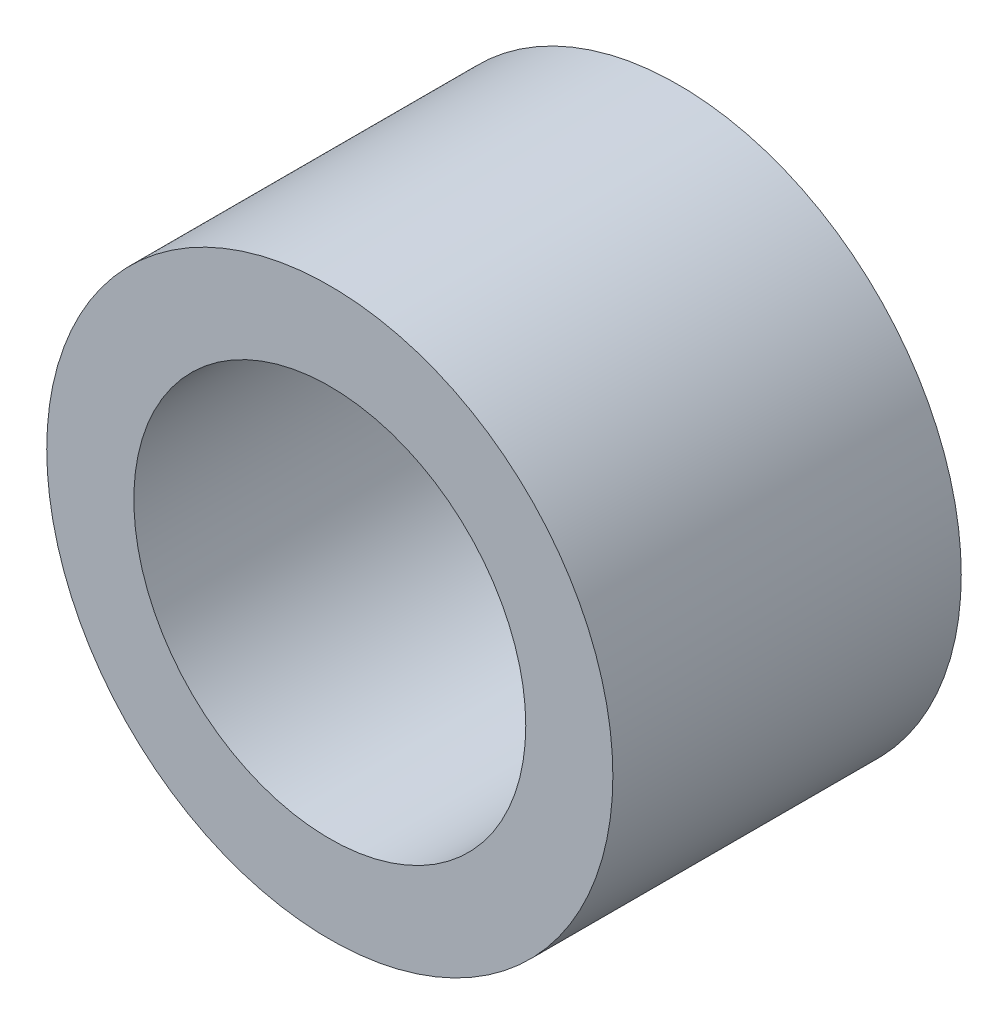
ISO-10303-21;
HEADER;
FILE_DESCRIPTION(('STEP AP214'),'2;1');
FILE_NAME('part.step','',(''),(''),'','','');
FILE_SCHEMA(('AUTOMOTIVE_DESIGN { 1 0 10303 214 1 1 1 1 }'));
ENDSEC;
DATA;
#1=APPLICATION_CONTEXT('core data for automotive mechanical design processes');
#2=APPLICATION_PROTOCOL_DEFINITION('international standard','automotive_design',2000,#1);
#3=PRODUCT_CONTEXT('',#1,'mechanical');
#4=PRODUCT('Part','Part','',(#3));
#5=PRODUCT_RELATED_PRODUCT_CATEGORY('part','',(#4));
#6=PRODUCT_DEFINITION_FORMATION('','',#4);
#7=PRODUCT_DEFINITION_CONTEXT('part definition',#1,'design');
#8=PRODUCT_DEFINITION('design','',#6,#7);
#9=PRODUCT_DEFINITION_SHAPE('','',#8);
#10=(LENGTH_UNIT() NAMED_UNIT(*) SI_UNIT(.MILLI.,.METRE.));
#11=(NAMED_UNIT(*) PLANE_ANGLE_UNIT() SI_UNIT($,.RADIAN.));
#12=(NAMED_UNIT(*) SI_UNIT($,.STERADIAN.) SOLID_ANGLE_UNIT());
#13=UNCERTAINTY_MEASURE_WITH_UNIT(LENGTH_MEASURE(1.E-05),#10,'distance_accuracy_value','');
#14=(GEOMETRIC_REPRESENTATION_CONTEXT(3) GLOBAL_UNCERTAINTY_ASSIGNED_CONTEXT((#13)) GLOBAL_UNIT_ASSIGNED_CONTEXT((#10,
#11,#12)) REPRESENTATION_CONTEXT('',''));
#15=CARTESIAN_POINT('',(0.,0.,0.));
#16=DIRECTION('',(0.,0.,1.));
#17=DIRECTION('',(1.,0.,0.));
#18=AXIS2_PLACEMENT_3D('',#15,#16,#17);
#19=CARTESIAN_POINT('',(0.,0.,4.));
#20=DIRECTION('',(0.,0.,1.));
#21=DIRECTION('',(1.,0.,0.));
#22=AXIS2_PLACEMENT_3D('',#19,#20,#21);
#23=PLANE('',#22);
#24=CARTESIAN_POINT('',(0.,0.,4.));
#25=DIRECTION('',(0.,0.,1.));
#26=DIRECTION('',(1.,0.,0.));
#27=AXIS2_PLACEMENT_3D('',#24,#25,#26);
#28=CIRCLE('',#27,3.25);
#29=CARTESIAN_POINT('',(3.25,0.,4.));
#30=VERTEX_POINT('',#29);
#31=EDGE_CURVE('E10',#30,#30,#28,.T.);
#32=ORIENTED_EDGE('',*,*,#31,.T.);
#33=EDGE_LOOP('',(#32));
#34=FACE_BOUND('',#33,.T.);
#35=CARTESIAN_POINT('',(0.,0.,4.));
#36=DIRECTION('',(0.,0.,1.));
#37=DIRECTION('',(1.,0.,0.));
#38=AXIS2_PLACEMENT_3D('',#35,#36,#37);
#39=CIRCLE('',#38,2.25);
#40=CARTESIAN_POINT('',(2.25,0.,4.));
#41=VERTEX_POINT('',#40);
#42=EDGE_CURVE('E42',#41,#41,#39,.T.);
#43=ORIENTED_EDGE('',*,*,#42,.F.);
#44=EDGE_LOOP('',(#43));
#45=FACE_BOUND('',#44,.T.);
#46=ADVANCED_FACE('F31',(#34,#45),#23,.T.);
#47=CARTESIAN_POINT('',(0.,0.,0.));
#48=DIRECTION('',(0.,0.,1.));
#49=DIRECTION('',(1.,0.,0.));
#50=AXIS2_PLACEMENT_3D('',#47,#48,#49);
#51=PLANE('',#50);
#52=CARTESIAN_POINT('',(0.,0.,0.));
#53=DIRECTION('',(0.,0.,1.));
#54=DIRECTION('',(1.,0.,0.));
#55=AXIS2_PLACEMENT_3D('',#52,#53,#54);
#56=CIRCLE('',#55,3.25);
#57=CARTESIAN_POINT('',(3.25,0.,0.));
#58=VERTEX_POINT('',#57);
#59=EDGE_CURVE('E35',#58,#58,#56,.T.);
#60=ORIENTED_EDGE('',*,*,#59,.F.);
#61=EDGE_LOOP('',(#60));
#62=FACE_BOUND('',#61,.T.);
#63=CARTESIAN_POINT('',(0.,0.,0.));
#64=DIRECTION('',(0.,0.,1.));
#65=DIRECTION('',(1.,0.,0.));
#66=AXIS2_PLACEMENT_3D('',#63,#64,#65);
#67=CIRCLE('',#66,2.25);
#68=CARTESIAN_POINT('',(2.25,0.,0.));
#69=VERTEX_POINT('',#68);
#70=EDGE_CURVE('E44',#69,#69,#67,.T.);
#71=ORIENTED_EDGE('',*,*,#70,.T.);
#72=EDGE_LOOP('',(#71));
#73=FACE_BOUND('',#72,.T.);
#74=ADVANCED_FACE('F54',(#62,#73),#51,.F.);
#75=CARTESIAN_POINT('',(0.,0.,4.));
#76=DIRECTION('',(0.,0.,-1.));
#77=DIRECTION('',(-1.,0.,0.));
#78=AXIS2_PLACEMENT_3D('',#75,#76,#77);
#79=CYLINDRICAL_SURFACE('',#78,3.25);
#80=ORIENTED_EDGE('',*,*,#31,.F.);
#81=EDGE_LOOP('',(#80));
#82=FACE_BOUND('',#81,.T.);
#83=ORIENTED_EDGE('',*,*,#59,.T.);
#84=EDGE_LOOP('',(#83));
#85=FACE_BOUND('',#84,.T.);
#86=ADVANCED_FACE('F33',(#82,#85),#79,.T.);
#87=CARTESIAN_POINT('',(0.,0.,4.));
#88=DIRECTION('',(0.,0.,-1.));
#89=DIRECTION('',(-1.,0.,0.));
#90=AXIS2_PLACEMENT_3D('',#87,#88,#89);
#91=CYLINDRICAL_SURFACE('',#90,2.25);
#92=ORIENTED_EDGE('',*,*,#42,.T.);
#93=EDGE_LOOP('',(#92));
#94=FACE_BOUND('',#93,.T.);
#95=ORIENTED_EDGE('',*,*,#70,.F.);
#96=EDGE_LOOP('',(#95));
#97=FACE_BOUND('',#96,.T.);
#98=ADVANCED_FACE('F50',(#94,#97),#91,.F.);
#99=CLOSED_SHELL('',(#46,#74,#86,#98));
#100=MANIFOLD_SOLID_BREP('B2',#99);
#101=ADVANCED_BREP_SHAPE_REPRESENTATION('',(#18,#100),#14);
#102=SHAPE_DEFINITION_REPRESENTATION(#9,#101);
ENDSEC;
END-ISO-10303-21;
